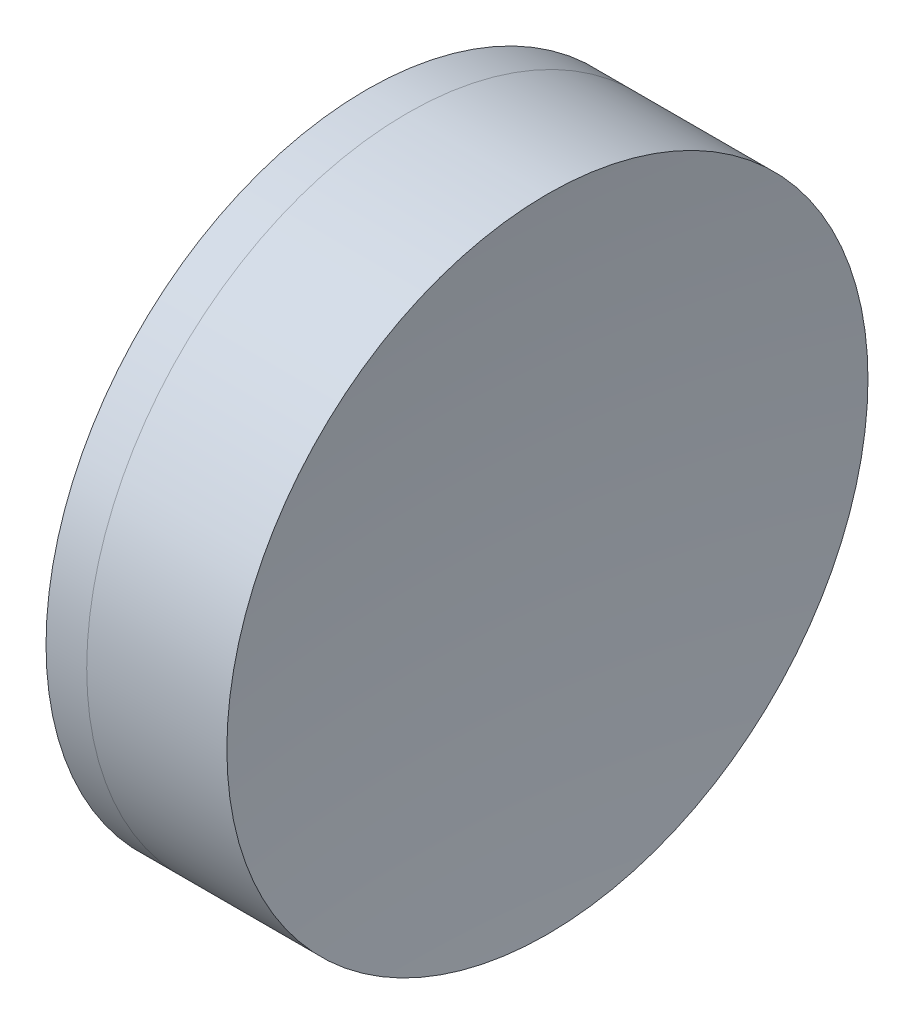
ISO-10303-21;
HEADER;
FILE_DESCRIPTION(('STEP AP214'),'2;1');
FILE_NAME('part.step','',(''),(''),'','','');
FILE_SCHEMA(('AUTOMOTIVE_DESIGN { 1 0 10303 214 1 1 1 1 }'));
ENDSEC;
DATA;
#1=APPLICATION_CONTEXT('core data for automotive mechanical design processes');
#2=APPLICATION_PROTOCOL_DEFINITION('international standard','automotive_design',2000,#1);
#3=PRODUCT_CONTEXT('',#1,'mechanical');
#4=PRODUCT('Part','Part','',(#3));
#5=PRODUCT_RELATED_PRODUCT_CATEGORY('part','',(#4));
#6=PRODUCT_DEFINITION_FORMATION('','',#4);
#7=PRODUCT_DEFINITION_CONTEXT('part definition',#1,'design');
#8=PRODUCT_DEFINITION('design','',#6,#7);
#9=PRODUCT_DEFINITION_SHAPE('','',#8);
#10=(LENGTH_UNIT() NAMED_UNIT(*) SI_UNIT(.MILLI.,.METRE.));
#11=(NAMED_UNIT(*) PLANE_ANGLE_UNIT() SI_UNIT($,.RADIAN.));
#12=(NAMED_UNIT(*) SI_UNIT($,.STERADIAN.) SOLID_ANGLE_UNIT());
#13=UNCERTAINTY_MEASURE_WITH_UNIT(LENGTH_MEASURE(1.E-05),#10,'distance_accuracy_value','');
#14=(GEOMETRIC_REPRESENTATION_CONTEXT(3) GLOBAL_UNCERTAINTY_ASSIGNED_CONTEXT((#13)) GLOBAL_UNIT_ASSIGNED_CONTEXT((#10,
#11,#12)) REPRESENTATION_CONTEXT('',''));
#15=CARTESIAN_POINT('',(0.,0.,0.));
#16=DIRECTION('',(0.,0.,1.));
#17=DIRECTION('',(1.,0.,0.));
#18=AXIS2_PLACEMENT_3D('',#15,#16,#17);
#19=CARTESIAN_POINT('',(13.3866192160233,0.,0.));
#20=DIRECTION('',(-1.,0.,0.));
#21=DIRECTION('',(0.,0.,1.));
#22=AXIS2_PLACEMENT_3D('',#19,#20,#21);
#23=SPHERICAL_SURFACE('',#22,28.1200000000001);
#24=CARTESIAN_POINT('',(38.4753497538565,0.,0.));
#25=DIRECTION('',(-1.,0.,0.));
#26=DIRECTION('',(0.,0.,1.));
#27=AXIS2_PLACEMENT_3D('',#24,#25,#26);
#28=CIRCLE('',#27,12.7);
#29=CARTESIAN_POINT('',(38.4753497538565,0.,12.7));
#30=VERTEX_POINT('',#29);
#31=EDGE_CURVE('E51',#30,#30,#28,.T.);
#32=ORIENTED_EDGE('',*,*,#31,.T.);
#33=EDGE_LOOP('',(#32));
#34=FACE_BOUND('',#33,.T.);
#35=ADVANCED_FACE('F45',(#34),#23,.F.);
#36=CARTESIAN_POINT('',(155.386619216023,0.,0.));
#37=DIRECTION('',(-1.,0.,0.));
#38=DIRECTION('',(0.,0.,-1.));
#39=AXIS2_PLACEMENT_3D('',#36,#37,#38);
#40=SPHERICAL_SURFACE('',#39,112.08);
#41=CARTESIAN_POINT('',(44.0284744757306,0.,0.));
#42=DIRECTION('',(-1.,0.,0.));
#43=DIRECTION('',(0.,0.,1.));
#44=AXIS2_PLACEMENT_3D('',#41,#42,#43);
#45=CIRCLE('',#44,12.7);
#46=CARTESIAN_POINT('',(44.0284744757306,0.,12.7));
#47=VERTEX_POINT('',#46);
#48=EDGE_CURVE('E11',#47,#47,#45,.T.);
#49=ORIENTED_EDGE('',*,*,#48,.F.);
#50=EDGE_LOOP('',(#49));
#51=FACE_BOUND('',#50,.T.);
#52=ADVANCED_FACE('F60',(#51),#40,.F.);
#53=CARTESIAN_POINT('',(-0.551919992657797,0.,0.));
#54=DIRECTION('',(-1.,0.,0.));
#55=DIRECTION('',(0.,0.,1.));
#56=AXIS2_PLACEMENT_3D('',#53,#54,#55);
#57=CYLINDRICAL_SURFACE('',#56,12.7);
#58=ORIENTED_EDGE('',*,*,#48,.T.);
#59=EDGE_LOOP('',(#58));
#60=FACE_BOUND('',#59,.T.);
#61=ORIENTED_EDGE('',*,*,#31,.F.);
#62=EDGE_LOOP('',(#61));
#63=FACE_BOUND('',#62,.T.);
#64=ADVANCED_FACE('F58',(#60,#63),#57,.T.);
#65=CLOSED_SHELL('',(#35,#52,#64));
#66=MANIFOLD_SOLID_BREP('B2',#65);
#67=CARTESIAN_POINT('',(57.0866192160233,0.,0.));
#68=DIRECTION('',(-1.,0.,0.));
#69=DIRECTION('',(0.,0.,1.));
#70=AXIS2_PLACEMENT_3D('',#67,#68,#69);
#71=SPHERICAL_SURFACE('',#70,23.88);
#72=CARTESIAN_POINT('',(36.863750972374,0.,0.));
#73=DIRECTION('',(-1.,0.,0.));
#74=DIRECTION('',(0.,0.,1.));
#75=AXIS2_PLACEMENT_3D('',#72,#73,#74);
#76=CIRCLE('',#75,12.7);
#77=CARTESIAN_POINT('',(36.863750972374,0.,12.7));
#78=VERTEX_POINT('',#77);
#79=EDGE_CURVE('E44',#78,#78,#76,.T.);
#80=ORIENTED_EDGE('',*,*,#79,.T.);
#81=EDGE_LOOP('',(#80));
#82=FACE_BOUND('',#81,.T.);
#83=ADVANCED_FACE('F86',(#82),#71,.T.);
#84=CARTESIAN_POINT('',(-0.816062176165804,0.,0.));
#85=DIRECTION('',(-1.,0.,0.));
#86=DIRECTION('',(0.,0.,1.));
#87=AXIS2_PLACEMENT_3D('',#84,#85,#86);
#88=CYLINDRICAL_SURFACE('',#87,12.7);
#89=CARTESIAN_POINT('',(38.4753497538565,0.,0.));
#90=DIRECTION('',(-1.,0.,0.));
#91=DIRECTION('',(0.,0.,1.));
#92=AXIS2_PLACEMENT_3D('',#89,#90,#91);
#93=CIRCLE('',#92,12.7);
#94=CARTESIAN_POINT('',(38.4753497538565,0.,12.7));
#95=VERTEX_POINT('',#94);
#96=EDGE_CURVE('E92',#95,#95,#93,.T.);
#97=ORIENTED_EDGE('',*,*,#96,.T.);
#98=EDGE_LOOP('',(#97));
#99=FACE_BOUND('',#98,.T.);
#100=ORIENTED_EDGE('',*,*,#79,.F.);
#101=EDGE_LOOP('',(#100));
#102=FACE_BOUND('',#101,.T.);
#103=ADVANCED_FACE('F98',(#99,#102),#88,.T.);
#104=CARTESIAN_POINT('',(13.3866192160233,0.,0.));
#105=DIRECTION('',(-1.,0.,0.));
#106=DIRECTION('',(0.,0.,1.));
#107=AXIS2_PLACEMENT_3D('',#104,#105,#106);
#108=SPHERICAL_SURFACE('',#107,28.1200000000001);
#109=ORIENTED_EDGE('',*,*,#96,.F.);
#110=EDGE_LOOP('',(#109));
#111=FACE_BOUND('',#110,.T.);
#112=ADVANCED_FACE('F101',(#111),#108,.T.);
#113=CLOSED_SHELL('',(#83,#103,#112));
#114=MANIFOLD_SOLID_BREP('B6',#113);
#115=ADVANCED_BREP_SHAPE_REPRESENTATION('',(#18,#66,#114),#14);
#116=SHAPE_DEFINITION_REPRESENTATION(#9,#115);
ENDSEC;
END-ISO-10303-21;
